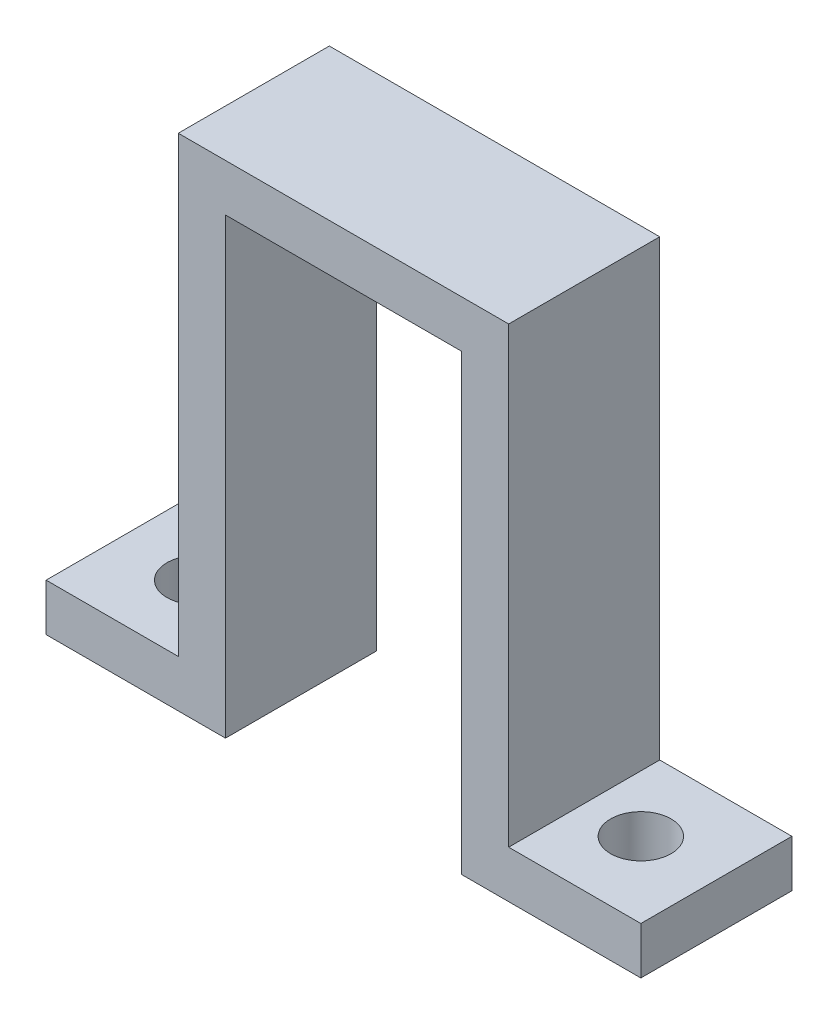
ISO-10303-21;
HEADER;
FILE_DESCRIPTION(('STEP AP214'),'2;1');
FILE_NAME('part.step','',(''),(''),'','','');
FILE_SCHEMA(('AUTOMOTIVE_DESIGN { 1 0 10303 214 1 1 1 1 }'));
ENDSEC;
DATA;
#1=APPLICATION_CONTEXT('core data for automotive mechanical design processes');
#2=APPLICATION_PROTOCOL_DEFINITION('international standard','automotive_design',2000,#1);
#3=PRODUCT_CONTEXT('',#1,'mechanical');
#4=PRODUCT('Part','Part','',(#3));
#5=PRODUCT_RELATED_PRODUCT_CATEGORY('part','',(#4));
#6=PRODUCT_DEFINITION_FORMATION('','',#4);
#7=PRODUCT_DEFINITION_CONTEXT('part definition',#1,'design');
#8=PRODUCT_DEFINITION('design','',#6,#7);
#9=PRODUCT_DEFINITION_SHAPE('','',#8);
#10=(LENGTH_UNIT() NAMED_UNIT(*) SI_UNIT(.MILLI.,.METRE.));
#11=(NAMED_UNIT(*) PLANE_ANGLE_UNIT() SI_UNIT($,.RADIAN.));
#12=(NAMED_UNIT(*) SI_UNIT($,.STERADIAN.) SOLID_ANGLE_UNIT());
#13=UNCERTAINTY_MEASURE_WITH_UNIT(LENGTH_MEASURE(1.E-05),#10,'distance_accuracy_value','');
#14=(GEOMETRIC_REPRESENTATION_CONTEXT(3) GLOBAL_UNCERTAINTY_ASSIGNED_CONTEXT((#13)) GLOBAL_UNIT_ASSIGNED_CONTEXT((#10,
#11,#12)) REPRESENTATION_CONTEXT('',''));
#15=CARTESIAN_POINT('',(0.,0.,0.));
#16=DIRECTION('',(0.,0.,1.));
#17=DIRECTION('',(1.,0.,0.));
#18=AXIS2_PLACEMENT_3D('',#15,#16,#17);
#19=CARTESIAN_POINT('',(-15.6531531531532,-0.652491563631338,8.));
#20=DIRECTION('',(1.,0.,0.));
#21=DIRECTION('',(0.,0.,-1.));
#22=AXIS2_PLACEMENT_3D('',#19,#20,#21);
#23=PLANE('',#22);
#24=DIRECTION('',(0.,-1.,0.));
#25=VECTOR('',#24,1.);
#26=CARTESIAN_POINT('',(-15.6531531531532,-0.652491563631338,0.));
#27=LINE('',#26,#25);
#28=CARTESIAN_POINT('',(-15.6531531531532,1.84750843636866,0.));
#29=VERTEX_POINT('',#28);
#30=CARTESIAN_POINT('',(-15.6531531531532,-0.652491563631338,0.));
#31=VERTEX_POINT('',#30);
#32=EDGE_CURVE('E170',#29,#31,#27,.T.);
#33=ORIENTED_EDGE('',*,*,#32,.T.);
#34=DIRECTION('',(0.,0.,-1.));
#35=VECTOR('',#34,1.);
#36=CARTESIAN_POINT('',(-15.6531531531532,-0.652491563631338,8.));
#37=LINE('',#36,#35);
#38=CARTESIAN_POINT('',(-15.6531531531532,-0.652491563631338,8.));
#39=VERTEX_POINT('',#38);
#40=EDGE_CURVE('E11',#39,#31,#37,.T.);
#41=ORIENTED_EDGE('',*,*,#40,.F.);
#42=DIRECTION('',(0.,-1.,0.));
#43=VECTOR('',#42,1.);
#44=CARTESIAN_POINT('',(-15.6531531531532,-0.652491563631338,8.));
#45=LINE('',#44,#43);
#46=CARTESIAN_POINT('',(-15.6531531531532,1.84750843636866,8.));
#47=VERTEX_POINT('',#46);
#48=EDGE_CURVE('E205',#47,#39,#45,.T.);
#49=ORIENTED_EDGE('',*,*,#48,.F.);
#50=DIRECTION('',(0.,0.,-1.));
#51=VECTOR('',#50,1.);
#52=CARTESIAN_POINT('',(-15.6531531531532,1.84750843636866,8.));
#53=LINE('',#52,#51);
#54=EDGE_CURVE('E166',#47,#29,#53,.T.);
#55=ORIENTED_EDGE('',*,*,#54,.T.);
#56=EDGE_LOOP('',(#33,#41,#49,#55));
#57=FACE_BOUND('',#56,.T.);
#58=ADVANCED_FACE('F45',(#57),#23,.F.);
#59=CARTESIAN_POINT('',(-6.15315315315315,-0.652491563631336,8.));
#60=DIRECTION('',(0.,1.,0.));
#61=DIRECTION('',(-1.,0.,0.));
#62=AXIS2_PLACEMENT_3D('',#59,#60,#61);
#63=PLANE('',#62);
#64=CARTESIAN_POINT('',(-11.6531531531531,-0.652491563631338,4.));
#65=DIRECTION('',(0.,1.,0.));
#66=DIRECTION('',(-1.,0.,0.));
#67=AXIS2_PLACEMENT_3D('',#64,#65,#66);
#68=CIRCLE('',#67,1.6);
#69=CARTESIAN_POINT('',(-13.2531531531531,-0.652491563631338,4.));
#70=VERTEX_POINT('',#69);
#71=EDGE_CURVE('E381',#70,#70,#68,.T.);
#72=ORIENTED_EDGE('',*,*,#71,.T.);
#73=EDGE_LOOP('',(#72));
#74=FACE_BOUND('',#73,.T.);
#75=DIRECTION('',(1.,0.,0.));
#76=VECTOR('',#75,1.);
#77=CARTESIAN_POINT('',(-6.15315315315315,-0.652491563631336,0.));
#78=LINE('',#77,#76);
#79=CARTESIAN_POINT('',(-6.15315315315315,-0.652491563631336,0.));
#80=VERTEX_POINT('',#79);
#81=EDGE_CURVE('E174',#31,#80,#78,.T.);
#82=ORIENTED_EDGE('',*,*,#81,.T.);
#83=DIRECTION('',(0.,0.,-1.));
#84=VECTOR('',#83,1.);
#85=CARTESIAN_POINT('',(-6.15315315315315,-0.652491563631336,8.));
#86=LINE('',#85,#84);
#87=CARTESIAN_POINT('',(-6.15315315315315,-0.652491563631336,8.));
#88=VERTEX_POINT('',#87);
#89=EDGE_CURVE('E54',#88,#80,#86,.T.);
#90=ORIENTED_EDGE('',*,*,#89,.F.);
#91=DIRECTION('',(1.,0.,0.));
#92=VECTOR('',#91,1.);
#93=CARTESIAN_POINT('',(-6.15315315315315,-0.652491563631336,8.));
#94=LINE('',#93,#92);
#95=EDGE_CURVE('E117',#39,#88,#94,.T.);
#96=ORIENTED_EDGE('',*,*,#95,.F.);
#97=ORIENTED_EDGE('',*,*,#40,.T.);
#98=EDGE_LOOP('',(#82,#90,#96,#97));
#99=FACE_BOUND('',#98,.T.);
#100=ADVANCED_FACE('F303',(#74,#99),#63,.F.);
#101=CARTESIAN_POINT('',(-6.15315315315315,23.3475084363687,8.));
#102=DIRECTION('',(-1.,0.,0.));
#103=DIRECTION('',(0.,-1.,0.));
#104=AXIS2_PLACEMENT_3D('',#101,#102,#103);
#105=PLANE('',#104);
#106=DIRECTION('',(0.,1.,0.));
#107=VECTOR('',#106,1.);
#108=CARTESIAN_POINT('',(-6.15315315315315,23.3475084363687,0.));
#109=LINE('',#108,#107);
#110=CARTESIAN_POINT('',(-6.15315315315315,23.3475084363687,0.));
#111=VERTEX_POINT('',#110);
#112=EDGE_CURVE('E178',#80,#111,#109,.T.);
#113=ORIENTED_EDGE('',*,*,#112,.T.);
#114=DIRECTION('',(0.,0.,-1.));
#115=VECTOR('',#114,1.);
#116=CARTESIAN_POINT('',(-6.15315315315315,23.3475084363687,8.));
#117=LINE('',#116,#115);
#118=CARTESIAN_POINT('',(-6.15315315315315,23.3475084363687,8.));
#119=VERTEX_POINT('',#118);
#120=EDGE_CURVE('E232',#119,#111,#117,.T.);
#121=ORIENTED_EDGE('',*,*,#120,.F.);
#122=DIRECTION('',(0.,1.,0.));
#123=VECTOR('',#122,1.);
#124=CARTESIAN_POINT('',(-6.15315315315315,23.3475084363687,8.));
#125=LINE('',#124,#123);
#126=EDGE_CURVE('E242',#88,#119,#125,.T.);
#127=ORIENTED_EDGE('',*,*,#126,.F.);
#128=ORIENTED_EDGE('',*,*,#89,.T.);
#129=EDGE_LOOP('',(#113,#121,#127,#128));
#130=FACE_BOUND('',#129,.T.);
#131=ADVANCED_FACE('F240',(#130),#105,.F.);
#132=CARTESIAN_POINT('',(6.34684684684685,23.3475084363687,8.));
#133=DIRECTION('',(0.,1.,0.));
#134=DIRECTION('',(0.,0.,1.));
#135=AXIS2_PLACEMENT_3D('',#132,#133,#134);
#136=PLANE('',#135);
#137=DIRECTION('',(1.,0.,0.));
#138=VECTOR('',#137,1.);
#139=CARTESIAN_POINT('',(6.34684684684685,23.3475084363687,0.));
#140=LINE('',#139,#138);
#141=CARTESIAN_POINT('',(6.34684684684685,23.3475084363687,0.));
#142=VERTEX_POINT('',#141);
#143=EDGE_CURVE('E181',#111,#142,#140,.T.);
#144=ORIENTED_EDGE('',*,*,#143,.T.);
#145=DIRECTION('',(0.,0.,-1.));
#146=VECTOR('',#145,1.);
#147=CARTESIAN_POINT('',(6.34684684684685,23.3475084363687,8.));
#148=LINE('',#147,#146);
#149=CARTESIAN_POINT('',(6.34684684684685,23.3475084363687,8.));
#150=VERTEX_POINT('',#149);
#151=EDGE_CURVE('E228',#150,#142,#148,.T.);
#152=ORIENTED_EDGE('',*,*,#151,.F.);
#153=DIRECTION('',(1.,0.,0.));
#154=VECTOR('',#153,1.);
#155=CARTESIAN_POINT('',(6.34684684684685,23.3475084363687,8.));
#156=LINE('',#155,#154);
#157=EDGE_CURVE('E261',#119,#150,#156,.T.);
#158=ORIENTED_EDGE('',*,*,#157,.F.);
#159=ORIENTED_EDGE('',*,*,#120,.T.);
#160=EDGE_LOOP('',(#144,#152,#158,#159));
#161=FACE_BOUND('',#160,.T.);
#162=ADVANCED_FACE('F251',(#161),#136,.F.);
#163=CARTESIAN_POINT('',(6.34684684684685,-0.652491563631335,8.));
#164=DIRECTION('',(1.,0.,0.));
#165=DIRECTION('',(0.,0.,-1.));
#166=AXIS2_PLACEMENT_3D('',#163,#164,#165);
#167=PLANE('',#166);
#168=DIRECTION('',(0.,-1.,0.));
#169=VECTOR('',#168,1.);
#170=CARTESIAN_POINT('',(6.34684684684685,-0.652491563631335,0.));
#171=LINE('',#170,#169);
#172=CARTESIAN_POINT('',(6.34684684684685,-0.652491563631335,0.));
#173=VERTEX_POINT('',#172);
#174=EDGE_CURVE('E184',#142,#173,#171,.T.);
#175=ORIENTED_EDGE('',*,*,#174,.T.);
#176=DIRECTION('',(0.,0.,-1.));
#177=VECTOR('',#176,1.);
#178=CARTESIAN_POINT('',(6.34684684684685,-0.652491563631335,8.));
#179=LINE('',#178,#177);
#180=CARTESIAN_POINT('',(6.34684684684685,-0.652491563631335,8.));
#181=VERTEX_POINT('',#180);
#182=EDGE_CURVE('E224',#181,#173,#179,.T.);
#183=ORIENTED_EDGE('',*,*,#182,.F.);
#184=DIRECTION('',(0.,-1.,0.));
#185=VECTOR('',#184,1.);
#186=CARTESIAN_POINT('',(6.34684684684685,-0.652491563631335,8.));
#187=LINE('',#186,#185);
#188=EDGE_CURVE('E257',#150,#181,#187,.T.);
#189=ORIENTED_EDGE('',*,*,#188,.F.);
#190=ORIENTED_EDGE('',*,*,#151,.T.);
#191=EDGE_LOOP('',(#175,#183,#189,#190));
#192=FACE_BOUND('',#191,.T.);
#193=ADVANCED_FACE('F255',(#192),#167,.F.);
#194=CARTESIAN_POINT('',(15.8468468468469,-0.652491563631334,8.));
#195=DIRECTION('',(0.,1.,0.));
#196=DIRECTION('',(-1.,0.,0.));
#197=AXIS2_PLACEMENT_3D('',#194,#195,#196);
#198=PLANE('',#197);
#199=CARTESIAN_POINT('',(11.8468468468469,-0.652491563631335,4.));
#200=DIRECTION('',(0.,1.,0.));
#201=DIRECTION('',(-1.,0.,0.));
#202=AXIS2_PLACEMENT_3D('',#199,#200,#201);
#203=CIRCLE('',#202,1.6);
#204=CARTESIAN_POINT('',(10.2468468468469,-0.652491563631335,4.));
#205=VERTEX_POINT('',#204);
#206=EDGE_CURVE('E175',#205,#205,#203,.T.);
#207=ORIENTED_EDGE('',*,*,#206,.T.);
#208=EDGE_LOOP('',(#207));
#209=FACE_BOUND('',#208,.T.);
#210=DIRECTION('',(1.,0.,0.));
#211=VECTOR('',#210,1.);
#212=CARTESIAN_POINT('',(15.8468468468469,-0.652491563631334,0.));
#213=LINE('',#212,#211);
#214=CARTESIAN_POINT('',(15.8468468468469,-0.652491563631334,0.));
#215=VERTEX_POINT('',#214);
#216=EDGE_CURVE('E187',#173,#215,#213,.T.);
#217=ORIENTED_EDGE('',*,*,#216,.T.);
#218=DIRECTION('',(0.,0.,-1.));
#219=VECTOR('',#218,1.);
#220=CARTESIAN_POINT('',(15.8468468468469,-0.652491563631334,8.));
#221=LINE('',#220,#219);
#222=CARTESIAN_POINT('',(15.8468468468469,-0.652491563631334,8.));
#223=VERTEX_POINT('',#222);
#224=EDGE_CURVE('E220',#223,#215,#221,.T.);
#225=ORIENTED_EDGE('',*,*,#224,.F.);
#226=DIRECTION('',(1.,0.,0.));
#227=VECTOR('',#226,1.);
#228=CARTESIAN_POINT('',(15.8468468468469,-0.652491563631334,8.));
#229=LINE('',#228,#227);
#230=EDGE_CURVE('E260',#181,#223,#229,.T.);
#231=ORIENTED_EDGE('',*,*,#230,.F.);
#232=ORIENTED_EDGE('',*,*,#182,.T.);
#233=EDGE_LOOP('',(#217,#225,#231,#232));
#234=FACE_BOUND('',#233,.T.);
#235=ADVANCED_FACE('F320',(#209,#234),#198,.F.);
#236=CARTESIAN_POINT('',(15.8468468468469,1.84750843636866,8.));
#237=DIRECTION('',(-1.,0.,0.));
#238=DIRECTION('',(0.,-1.,0.));
#239=AXIS2_PLACEMENT_3D('',#236,#237,#238);
#240=PLANE('',#239);
#241=DIRECTION('',(0.,1.,0.));
#242=VECTOR('',#241,1.);
#243=CARTESIAN_POINT('',(15.8468468468469,1.84750843636866,0.));
#244=LINE('',#243,#242);
#245=CARTESIAN_POINT('',(15.8468468468469,1.84750843636866,0.));
#246=VERTEX_POINT('',#245);
#247=EDGE_CURVE('E190',#215,#246,#244,.T.);
#248=ORIENTED_EDGE('',*,*,#247,.T.);
#249=DIRECTION('',(0.,0.,-1.));
#250=VECTOR('',#249,1.);
#251=CARTESIAN_POINT('',(15.8468468468469,1.84750843636866,8.));
#252=LINE('',#251,#250);
#253=CARTESIAN_POINT('',(15.8468468468469,1.84750843636866,8.));
#254=VERTEX_POINT('',#253);
#255=EDGE_CURVE('E216',#254,#246,#252,.T.);
#256=ORIENTED_EDGE('',*,*,#255,.F.);
#257=DIRECTION('',(0.,1.,0.));
#258=VECTOR('',#257,1.);
#259=CARTESIAN_POINT('',(15.8468468468469,1.84750843636866,8.));
#260=LINE('',#259,#258);
#261=EDGE_CURVE('E265',#223,#254,#260,.T.);
#262=ORIENTED_EDGE('',*,*,#261,.F.);
#263=ORIENTED_EDGE('',*,*,#224,.T.);
#264=EDGE_LOOP('',(#248,#256,#262,#263));
#265=FACE_BOUND('',#264,.T.);
#266=ADVANCED_FACE('F322',(#265),#240,.F.);
#267=CARTESIAN_POINT('',(8.84684684684686,1.84750843636866,8.));
#268=DIRECTION('',(0.,-1.,0.));
#269=DIRECTION('',(0.,0.,-1.));
#270=AXIS2_PLACEMENT_3D('',#267,#268,#269);
#271=PLANE('',#270);
#272=CARTESIAN_POINT('',(11.8468468468469,1.84750843636866,4.));
#273=DIRECTION('',(0.,1.,0.));
#274=DIRECTION('',(0.,0.,1.));
#275=AXIS2_PLACEMENT_3D('',#272,#273,#274);
#276=CIRCLE('',#275,1.6);
#277=CARTESIAN_POINT('',(11.8468468468469,1.84750843636866,5.6));
#278=VERTEX_POINT('',#277);
#279=EDGE_CURVE('E377',#278,#278,#276,.T.);
#280=ORIENTED_EDGE('',*,*,#279,.F.);
#281=EDGE_LOOP('',(#280));
#282=FACE_BOUND('',#281,.T.);
#283=DIRECTION('',(-1.,0.,0.));
#284=VECTOR('',#283,1.);
#285=CARTESIAN_POINT('',(8.84684684684686,1.84750843636866,0.));
#286=LINE('',#285,#284);
#287=CARTESIAN_POINT('',(8.84684684684686,1.84750843636866,0.));
#288=VERTEX_POINT('',#287);
#289=EDGE_CURVE('E193',#246,#288,#286,.T.);
#290=ORIENTED_EDGE('',*,*,#289,.T.);
#291=DIRECTION('',(0.,0.,-1.));
#292=VECTOR('',#291,1.);
#293=CARTESIAN_POINT('',(8.84684684684686,1.84750843636866,8.));
#294=LINE('',#293,#292);
#295=CARTESIAN_POINT('',(8.84684684684686,1.84750843636866,8.));
#296=VERTEX_POINT('',#295);
#297=EDGE_CURVE('E212',#296,#288,#294,.T.);
#298=ORIENTED_EDGE('',*,*,#297,.F.);
#299=DIRECTION('',(-1.,0.,0.));
#300=VECTOR('',#299,1.);
#301=CARTESIAN_POINT('',(8.84684684684686,1.84750843636866,8.));
#302=LINE('',#301,#300);
#303=EDGE_CURVE('E272',#254,#296,#302,.T.);
#304=ORIENTED_EDGE('',*,*,#303,.F.);
#305=ORIENTED_EDGE('',*,*,#255,.T.);
#306=EDGE_LOOP('',(#290,#298,#304,#305));
#307=FACE_BOUND('',#306,.T.);
#308=ADVANCED_FACE('F280',(#282,#307),#271,.F.);
#309=CARTESIAN_POINT('',(8.84684684684686,25.8475084363687,8.));
#310=DIRECTION('',(-1.,0.,0.));
#311=DIRECTION('',(0.,-1.,0.));
#312=AXIS2_PLACEMENT_3D('',#309,#310,#311);
#313=PLANE('',#312);
#314=DIRECTION('',(0.,1.,0.));
#315=VECTOR('',#314,1.);
#316=CARTESIAN_POINT('',(8.84684684684686,25.8475084363687,0.));
#317=LINE('',#316,#315);
#318=CARTESIAN_POINT('',(8.84684684684686,25.8475084363687,0.));
#319=VERTEX_POINT('',#318);
#320=EDGE_CURVE('E196',#288,#319,#317,.T.);
#321=ORIENTED_EDGE('',*,*,#320,.T.);
#322=DIRECTION('',(0.,0.,-1.));
#323=VECTOR('',#322,1.);
#324=CARTESIAN_POINT('',(8.84684684684686,25.8475084363687,8.));
#325=LINE('',#324,#323);
#326=CARTESIAN_POINT('',(8.84684684684686,25.8475084363687,8.));
#327=VERTEX_POINT('',#326);
#328=EDGE_CURVE('E159',#327,#319,#325,.T.);
#329=ORIENTED_EDGE('',*,*,#328,.F.);
#330=DIRECTION('',(0.,1.,0.));
#331=VECTOR('',#330,1.);
#332=CARTESIAN_POINT('',(8.84684684684686,25.8475084363687,8.));
#333=LINE('',#332,#331);
#334=EDGE_CURVE('E148',#296,#327,#333,.T.);
#335=ORIENTED_EDGE('',*,*,#334,.F.);
#336=ORIENTED_EDGE('',*,*,#297,.T.);
#337=EDGE_LOOP('',(#321,#329,#335,#336));
#338=FACE_BOUND('',#337,.T.);
#339=ADVANCED_FACE('F284',(#338),#313,.F.);
#340=CARTESIAN_POINT('',(-8.65315315315315,25.8475084363687,8.));
#341=DIRECTION('',(0.,-1.,0.));
#342=DIRECTION('',(0.,0.,-1.));
#343=AXIS2_PLACEMENT_3D('',#340,#341,#342);
#344=PLANE('',#343);
#345=DIRECTION('',(-1.,0.,0.));
#346=VECTOR('',#345,1.);
#347=CARTESIAN_POINT('',(-8.65315315315315,25.8475084363687,0.));
#348=LINE('',#347,#346);
#349=CARTESIAN_POINT('',(-8.65315315315315,25.8475084363687,0.));
#350=VERTEX_POINT('',#349);
#351=EDGE_CURVE('E157',#319,#350,#348,.T.);
#352=ORIENTED_EDGE('',*,*,#351,.T.);
#353=DIRECTION('',(0.,0.,-1.));
#354=VECTOR('',#353,1.);
#355=CARTESIAN_POINT('',(-8.65315315315315,25.8475084363687,8.));
#356=LINE('',#355,#354);
#357=CARTESIAN_POINT('',(-8.65315315315315,25.8475084363687,8.));
#358=VERTEX_POINT('',#357);
#359=EDGE_CURVE('E154',#358,#350,#356,.T.);
#360=ORIENTED_EDGE('',*,*,#359,.F.);
#361=DIRECTION('',(-1.,0.,0.));
#362=VECTOR('',#361,1.);
#363=CARTESIAN_POINT('',(-8.65315315315315,25.8475084363687,8.));
#364=LINE('',#363,#362);
#365=EDGE_CURVE('E142',#327,#358,#364,.T.);
#366=ORIENTED_EDGE('',*,*,#365,.F.);
#367=ORIENTED_EDGE('',*,*,#328,.T.);
#368=EDGE_LOOP('',(#352,#360,#366,#367));
#369=FACE_BOUND('',#368,.T.);
#370=ADVANCED_FACE('F155',(#369),#344,.F.);
#371=CARTESIAN_POINT('',(-8.65315315315315,1.84750843636866,8.));
#372=DIRECTION('',(1.,0.,0.));
#373=DIRECTION('',(0.,0.,-1.));
#374=AXIS2_PLACEMENT_3D('',#371,#372,#373);
#375=PLANE('',#374);
#376=DIRECTION('',(0.,-1.,0.));
#377=VECTOR('',#376,1.);
#378=CARTESIAN_POINT('',(-8.65315315315315,1.84750843636866,0.));
#379=LINE('',#378,#377);
#380=CARTESIAN_POINT('',(-8.65315315315315,1.84750843636866,0.));
#381=VERTEX_POINT('',#380);
#382=EDGE_CURVE('E103',#350,#381,#379,.T.);
#383=ORIENTED_EDGE('',*,*,#382,.T.);
#384=DIRECTION('',(0.,0.,-1.));
#385=VECTOR('',#384,1.);
#386=CARTESIAN_POINT('',(-8.65315315315315,1.84750843636866,8.));
#387=LINE('',#386,#385);
#388=CARTESIAN_POINT('',(-8.65315315315315,1.84750843636866,8.));
#389=VERTEX_POINT('',#388);
#390=EDGE_CURVE('E160',#389,#381,#387,.T.);
#391=ORIENTED_EDGE('',*,*,#390,.F.);
#392=DIRECTION('',(0.,-1.,0.));
#393=VECTOR('',#392,1.);
#394=CARTESIAN_POINT('',(-8.65315315315315,1.84750843636866,8.));
#395=LINE('',#394,#393);
#396=EDGE_CURVE('E146',#358,#389,#395,.T.);
#397=ORIENTED_EDGE('',*,*,#396,.F.);
#398=ORIENTED_EDGE('',*,*,#359,.T.);
#399=EDGE_LOOP('',(#383,#391,#397,#398));
#400=FACE_BOUND('',#399,.T.);
#401=ADVANCED_FACE('F162',(#400),#375,.F.);
#402=CARTESIAN_POINT('',(-15.6531531531532,1.84750843636866,8.));
#403=DIRECTION('',(0.,-1.,0.));
#404=DIRECTION('',(0.,0.,-1.));
#405=AXIS2_PLACEMENT_3D('',#402,#403,#404);
#406=PLANE('',#405);
#407=CARTESIAN_POINT('',(-11.6531531531531,1.84750843636866,4.));
#408=DIRECTION('',(0.,1.,0.));
#409=DIRECTION('',(0.,0.,1.));
#410=AXIS2_PLACEMENT_3D('',#407,#408,#409);
#411=CIRCLE('',#410,1.6);
#412=CARTESIAN_POINT('',(-11.6531531531531,1.84750843636866,5.6));
#413=VERTEX_POINT('',#412);
#414=EDGE_CURVE('E384',#413,#413,#411,.T.);
#415=ORIENTED_EDGE('',*,*,#414,.F.);
#416=EDGE_LOOP('',(#415));
#417=FACE_BOUND('',#416,.T.);
#418=DIRECTION('',(-1.,0.,0.));
#419=VECTOR('',#418,1.);
#420=CARTESIAN_POINT('',(-15.6531531531532,1.84750843636866,0.));
#421=LINE('',#420,#419);
#422=EDGE_CURVE('E109',#381,#29,#421,.T.);
#423=ORIENTED_EDGE('',*,*,#422,.T.);
#424=ORIENTED_EDGE('',*,*,#54,.F.);
#425=DIRECTION('',(-1.,0.,0.));
#426=VECTOR('',#425,1.);
#427=CARTESIAN_POINT('',(-15.6531531531532,1.84750843636866,8.));
#428=LINE('',#427,#426);
#429=EDGE_CURVE('E62',#389,#47,#428,.T.);
#430=ORIENTED_EDGE('',*,*,#429,.F.);
#431=ORIENTED_EDGE('',*,*,#390,.T.);
#432=EDGE_LOOP('',(#423,#424,#430,#431));
#433=FACE_BOUND('',#432,.T.);
#434=ADVANCED_FACE('F288',(#417,#433),#406,.F.);
#435=CARTESIAN_POINT('',(0.,0.,8.));
#436=DIRECTION('',(0.,0.,-1.));
#437=DIRECTION('',(-1.,0.,0.));
#438=AXIS2_PLACEMENT_3D('',#435,#436,#437);
#439=PLANE('',#438);
#440=ORIENTED_EDGE('',*,*,#48,.T.);
#441=ORIENTED_EDGE('',*,*,#95,.T.);
#442=ORIENTED_EDGE('',*,*,#126,.T.);
#443=ORIENTED_EDGE('',*,*,#157,.T.);
#444=ORIENTED_EDGE('',*,*,#188,.T.);
#445=ORIENTED_EDGE('',*,*,#230,.T.);
#446=ORIENTED_EDGE('',*,*,#261,.T.);
#447=ORIENTED_EDGE('',*,*,#303,.T.);
#448=ORIENTED_EDGE('',*,*,#334,.T.);
#449=ORIENTED_EDGE('',*,*,#365,.T.);
#450=ORIENTED_EDGE('',*,*,#396,.T.);
#451=ORIENTED_EDGE('',*,*,#429,.T.);
#452=EDGE_LOOP('',(#440,#441,#442,#443,#444,#445,#446,#447,#448,#449,#450,#451));
#453=FACE_BOUND('',#452,.T.);
#454=ADVANCED_FACE('F144',(#453),#439,.F.);
#455=CARTESIAN_POINT('',(0.,0.,0.));
#456=DIRECTION('',(0.,0.,-1.));
#457=DIRECTION('',(-1.,0.,0.));
#458=AXIS2_PLACEMENT_3D('',#455,#456,#457);
#459=PLANE('',#458);
#460=ORIENTED_EDGE('',*,*,#32,.F.);
#461=ORIENTED_EDGE('',*,*,#422,.F.);
#462=ORIENTED_EDGE('',*,*,#382,.F.);
#463=ORIENTED_EDGE('',*,*,#351,.F.);
#464=ORIENTED_EDGE('',*,*,#320,.F.);
#465=ORIENTED_EDGE('',*,*,#289,.F.);
#466=ORIENTED_EDGE('',*,*,#247,.F.);
#467=ORIENTED_EDGE('',*,*,#216,.F.);
#468=ORIENTED_EDGE('',*,*,#174,.F.);
#469=ORIENTED_EDGE('',*,*,#143,.F.);
#470=ORIENTED_EDGE('',*,*,#112,.F.);
#471=ORIENTED_EDGE('',*,*,#81,.F.);
#472=EDGE_LOOP('',(#460,#461,#462,#463,#464,#465,#466,#467,#468,#469,#470,#471));
#473=FACE_BOUND('',#472,.T.);
#474=ADVANCED_FACE('F246',(#473),#459,.T.);
#475=CARTESIAN_POINT('',(-11.6531531531531,-8.15249156363134,4.));
#476=DIRECTION('',(0.,1.,0.));
#477=DIRECTION('',(0.,0.,1.));
#478=AXIS2_PLACEMENT_3D('',#475,#476,#477);
#479=CYLINDRICAL_SURFACE('',#478,1.6);
#480=ORIENTED_EDGE('',*,*,#414,.T.);
#481=EDGE_LOOP('',(#480));
#482=FACE_BOUND('',#481,.T.);
#483=ORIENTED_EDGE('',*,*,#71,.F.);
#484=EDGE_LOOP('',(#483));
#485=FACE_BOUND('',#484,.T.);
#486=ADVANCED_FACE('F351',(#482,#485),#479,.F.);
#487=CARTESIAN_POINT('',(11.8468468468469,-8.15249156363134,4.));
#488=DIRECTION('',(0.,1.,0.));
#489=DIRECTION('',(0.,0.,1.));
#490=AXIS2_PLACEMENT_3D('',#487,#488,#489);
#491=CYLINDRICAL_SURFACE('',#490,1.6);
#492=ORIENTED_EDGE('',*,*,#279,.T.);
#493=EDGE_LOOP('',(#492));
#494=FACE_BOUND('',#493,.T.);
#495=ORIENTED_EDGE('',*,*,#206,.F.);
#496=EDGE_LOOP('',(#495));
#497=FACE_BOUND('',#496,.T.);
#498=ADVANCED_FACE('F361',(#494,#497),#491,.F.);
#499=CLOSED_SHELL('',(#58,#100,#131,#162,#193,#235,#266,#308,#339,#370,#401,#434,#454,#474,#486,#498));
#500=MANIFOLD_SOLID_BREP('B2',#499);
#501=ADVANCED_BREP_SHAPE_REPRESENTATION('',(#18,#500),#14);
#502=SHAPE_DEFINITION_REPRESENTATION(#9,#501);
ENDSEC;
END-ISO-10303-21;
